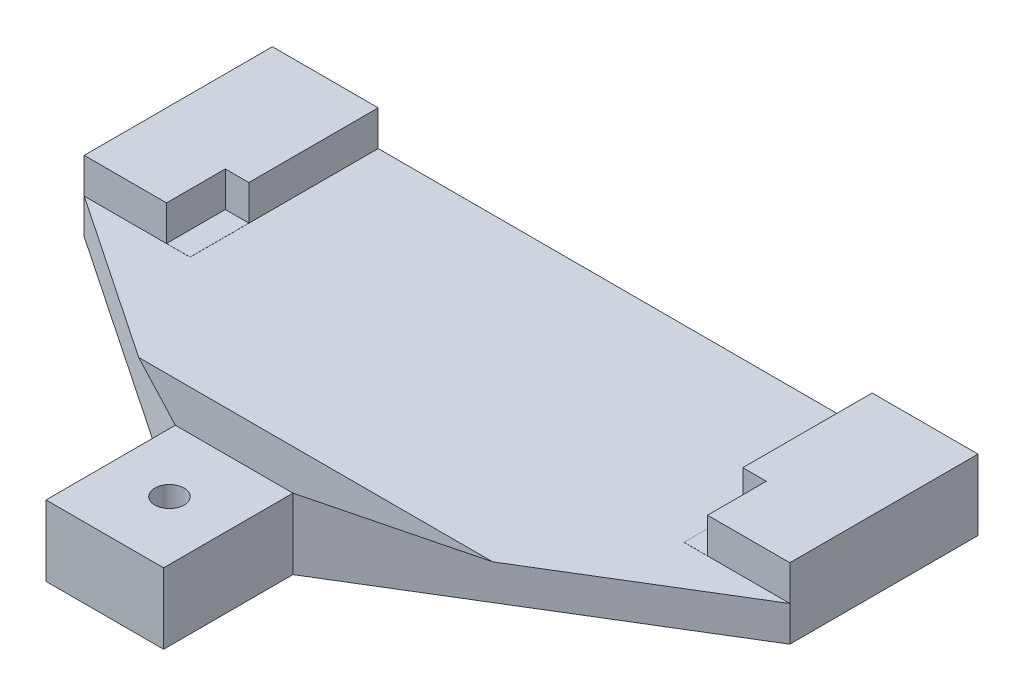
ISO-10303-21;
HEADER;
FILE_DESCRIPTION(('STEP AP214'),'2;1');
FILE_NAME('part.step','',(''),(''),'','','');
FILE_SCHEMA(('AUTOMOTIVE_DESIGN { 1 0 10303 214 1 1 1 1 }'));
ENDSEC;
DATA;
#1=APPLICATION_CONTEXT('core data for automotive mechanical design processes');
#2=APPLICATION_PROTOCOL_DEFINITION('international standard','automotive_design',2000,#1);
#3=PRODUCT_CONTEXT('',#1,'mechanical');
#4=PRODUCT('Part','Part','',(#3));
#5=PRODUCT_RELATED_PRODUCT_CATEGORY('part','',(#4));
#6=PRODUCT_DEFINITION_FORMATION('','',#4);
#7=PRODUCT_DEFINITION_CONTEXT('part definition',#1,'design');
#8=PRODUCT_DEFINITION('design','',#6,#7);
#9=PRODUCT_DEFINITION_SHAPE('','',#8);
#10=(LENGTH_UNIT() NAMED_UNIT(*) SI_UNIT(.MILLI.,.METRE.));
#11=(NAMED_UNIT(*) PLANE_ANGLE_UNIT() SI_UNIT($,.RADIAN.));
#12=(NAMED_UNIT(*) SI_UNIT($,.STERADIAN.) SOLID_ANGLE_UNIT());
#13=UNCERTAINTY_MEASURE_WITH_UNIT(LENGTH_MEASURE(1.E-05),#10,'distance_accuracy_value','');
#14=(GEOMETRIC_REPRESENTATION_CONTEXT(3) GLOBAL_UNCERTAINTY_ASSIGNED_CONTEXT((#13)) GLOBAL_UNIT_ASSIGNED_CONTEXT((#10,
#11,#12)) REPRESENTATION_CONTEXT('',''));
#15=CARTESIAN_POINT('',(0.,0.,0.));
#16=DIRECTION('',(0.,0.,1.));
#17=DIRECTION('',(1.,0.,0.));
#18=AXIS2_PLACEMENT_3D('',#15,#16,#17);
#19=CARTESIAN_POINT('',(0.,6.,60.));
#20=DIRECTION('',(0.,-1.,0.));
#21=DIRECTION('',(0.,0.,-1.));
#22=AXIS2_PLACEMENT_3D('',#19,#20,#21);
#23=PLANE('',#22);
#24=DIRECTION('',(-1.,0.,0.));
#25=VECTOR('',#24,1.);
#26=CARTESIAN_POINT('',(0.,6.,16.));
#27=LINE('',#26,#25);
#28=CARTESIAN_POINT('',(7.,6.,16.));
#29=VERTEX_POINT('',#28);
#30=CARTESIAN_POINT('',(0.,6.,16.));
#31=VERTEX_POINT('',#30);
#32=EDGE_CURVE('E270',#29,#31,#27,.T.);
#33=ORIENTED_EDGE('',*,*,#32,.F.);
#34=DIRECTION('',(0.,0.,1.));
#35=VECTOR('',#34,1.);
#36=CARTESIAN_POINT('',(7.,6.,16.));
#37=LINE('',#36,#35);
#38=CARTESIAN_POINT('',(7.,6.,11.));
#39=VERTEX_POINT('',#38);
#40=EDGE_CURVE('E187',#39,#29,#37,.T.);
#41=ORIENTED_EDGE('',*,*,#40,.F.);
#42=DIRECTION('',(-1.,0.,0.));
#43=VECTOR('',#42,1.);
#44=CARTESIAN_POINT('',(9.,6.,11.));
#45=LINE('',#44,#43);
#46=CARTESIAN_POINT('',(9.,6.,11.));
#47=VERTEX_POINT('',#46);
#48=EDGE_CURVE('E681',#47,#39,#45,.T.);
#49=ORIENTED_EDGE('',*,*,#48,.F.);
#50=DIRECTION('',(0.,0.,1.));
#51=VECTOR('',#50,1.);
#52=CARTESIAN_POINT('',(9.,6.,16.));
#53=LINE('',#52,#51);
#54=CARTESIAN_POINT('',(9.,6.,0.));
#55=VERTEX_POINT('',#54);
#56=EDGE_CURVE('E192',#55,#47,#53,.T.);
#57=ORIENTED_EDGE('',*,*,#56,.F.);
#58=DIRECTION('',(-1.,0.,0.));
#59=VECTOR('',#58,1.);
#60=CARTESIAN_POINT('',(0.,6.,0.));
#61=LINE('',#60,#59);
#62=CARTESIAN_POINT('',(0.,6.,0.));
#63=VERTEX_POINT('',#62);
#64=EDGE_CURVE('E329',#55,#63,#61,.T.);
#65=ORIENTED_EDGE('',*,*,#64,.T.);
#66=DIRECTION('',(0.,0.,-1.));
#67=VECTOR('',#66,1.);
#68=CARTESIAN_POINT('',(0.,6.,60.));
#69=LINE('',#68,#67);
#70=EDGE_CURVE('E333',#31,#63,#69,.T.);
#71=ORIENTED_EDGE('',*,*,#70,.F.);
#72=EDGE_LOOP('',(#33,#41,#49,#57,#65,#71));
#73=FACE_BOUND('',#72,.T.);
#74=ADVANCED_FACE('F33',(#73),#23,.F.);
#75=CARTESIAN_POINT('',(28.75,6.,37.5));
#76=DIRECTION('',(0.,1.,0.));
#77=DIRECTION('',(0.,0.,1.));
#78=AXIS2_PLACEMENT_3D('',#75,#76,#77);
#79=CIRCLE('',#78,1.25);
#80=CARTESIAN_POINT('',(28.75,6.,38.75));
#81=VERTEX_POINT('',#80);
#82=EDGE_CURVE('E291',#81,#81,#79,.T.);
#83=ORIENTED_EDGE('',*,*,#82,.F.);
#84=EDGE_LOOP('',(#83));
#85=FACE_BOUND('',#84,.T.);
#86=DIRECTION('',(0.,0.,1.));
#87=VECTOR('',#86,1.);
#88=CARTESIAN_POINT('',(23.75,6.,32.));
#89=LINE('',#88,#87);
#90=CARTESIAN_POINT('',(23.75,5.99999999999999,32.));
#91=VERTEX_POINT('',#90);
#92=CARTESIAN_POINT('',(23.75,6.,43.));
#93=VERTEX_POINT('',#92);
#94=EDGE_CURVE('E248',#91,#93,#89,.T.);
#95=ORIENTED_EDGE('',*,*,#94,.T.);
#96=DIRECTION('',(1.,0.,0.));
#97=VECTOR('',#96,1.);
#98=CARTESIAN_POINT('',(23.75,6.,43.));
#99=LINE('',#98,#97);
#100=CARTESIAN_POINT('',(33.75,6.,43.));
#101=VERTEX_POINT('',#100);
#102=EDGE_CURVE('E251',#93,#101,#99,.T.);
#103=ORIENTED_EDGE('',*,*,#102,.T.);
#104=DIRECTION('',(0.,0.,-1.));
#105=VECTOR('',#104,1.);
#106=CARTESIAN_POINT('',(33.75,6.,43.));
#107=LINE('',#106,#105);
#108=CARTESIAN_POINT('',(33.75,6.,32.));
#109=VERTEX_POINT('',#108);
#110=EDGE_CURVE('E254',#101,#109,#107,.T.);
#111=ORIENTED_EDGE('',*,*,#110,.T.);
#112=DIRECTION('',(-1.,0.,0.));
#113=VECTOR('',#112,1.);
#114=CARTESIAN_POINT('',(33.75,6.,32.));
#115=LINE('',#114,#113);
#116=EDGE_CURVE('E257',#109,#91,#115,.T.);
#117=ORIENTED_EDGE('',*,*,#116,.T.);
#118=EDGE_LOOP('',(#95,#103,#111,#117));
#119=FACE_BOUND('',#118,.T.);
#120=ADVANCED_FACE('F396',(#85,#119),#23,.F.);
#121=CARTESIAN_POINT('',(0.,0.,60.));
#122=DIRECTION('',(1.,0.,0.));
#123=DIRECTION('',(0.,0.,-1.));
#124=AXIS2_PLACEMENT_3D('',#121,#122,#123);
#125=PLANE('',#124);
#126=DIRECTION('',(0.,0.,-1.));
#127=VECTOR('',#126,1.);
#128=CARTESIAN_POINT('',(0.,0.,60.));
#129=LINE('',#128,#127);
#130=CARTESIAN_POINT('',(0.,0.,16.));
#131=VERTEX_POINT('',#130);
#132=CARTESIAN_POINT('',(0.,0.,0.));
#133=VERTEX_POINT('',#132);
#134=EDGE_CURVE('E339',#131,#133,#129,.T.);
#135=ORIENTED_EDGE('',*,*,#134,.F.);
#136=DIRECTION('',(0.,1.,0.));
#137=VECTOR('',#136,1.);
#138=CARTESIAN_POINT('',(0.,-49.,16.));
#139=LINE('',#138,#137);
#140=CARTESIAN_POINT('',(0.,3.,16.));
#141=VERTEX_POINT('',#140);
#142=EDGE_CURVE('E225',#131,#141,#139,.T.);
#143=ORIENTED_EDGE('',*,*,#142,.T.);
#144=DIRECTION('',(0.,1.,0.));
#145=VECTOR('',#144,1.);
#146=CARTESIAN_POINT('',(0.,3.,16.));
#147=LINE('',#146,#145);
#148=EDGE_CURVE('E288',#141,#31,#147,.T.);
#149=ORIENTED_EDGE('',*,*,#148,.T.);
#150=ORIENTED_EDGE('',*,*,#70,.T.);
#151=DIRECTION('',(0.,-1.,0.));
#152=VECTOR('',#151,1.);
#153=CARTESIAN_POINT('',(0.,0.,0.));
#154=LINE('',#153,#152);
#155=EDGE_CURVE('E318',#63,#133,#154,.T.);
#156=ORIENTED_EDGE('',*,*,#155,.T.);
#157=EDGE_LOOP('',(#135,#143,#149,#150,#156));
#158=FACE_BOUND('',#157,.T.);
#159=ADVANCED_FACE('F402',(#158),#125,.F.);
#160=CARTESIAN_POINT('',(0.,0.,60.));
#161=DIRECTION('',(0.,1.,0.));
#162=DIRECTION('',(0.,0.,1.));
#163=AXIS2_PLACEMENT_3D('',#160,#161,#162);
#164=PLANE('',#163);
#165=CARTESIAN_POINT('',(28.75,0.,37.5));
#166=DIRECTION('',(0.,1.,0.));
#167=DIRECTION('',(0.,0.,1.));
#168=AXIS2_PLACEMENT_3D('',#165,#166,#167);
#169=CIRCLE('',#168,1.25);
#170=CARTESIAN_POINT('',(28.75,0.,38.75));
#171=VERTEX_POINT('',#170);
#172=EDGE_CURVE('E305',#171,#171,#169,.T.);
#173=ORIENTED_EDGE('',*,*,#172,.T.);
#174=EDGE_LOOP('',(#173));
#175=FACE_BOUND('',#174,.T.);
#176=DIRECTION('',(0.,0.,-1.));
#177=VECTOR('',#176,1.);
#178=CARTESIAN_POINT('',(23.75,0.,60.));
#179=LINE('',#178,#177);
#180=CARTESIAN_POINT('',(23.75,0.,43.));
#181=VERTEX_POINT('',#180);
#182=CARTESIAN_POINT('',(23.75,0.,32.));
#183=VERTEX_POINT('',#182);
#184=EDGE_CURVE('E242',#181,#183,#179,.T.);
#185=ORIENTED_EDGE('',*,*,#184,.T.);
#186=DIRECTION('',(-0.829354370335837,0.,-0.558722944226248));
#187=VECTOR('',#186,1.);
#188=CARTESIAN_POINT('',(20.3886898864416,0.,29.7355384498133));
#189=LINE('',#188,#187);
#190=EDGE_CURVE('E245',#183,#131,#189,.T.);
#191=ORIENTED_EDGE('',*,*,#190,.T.);
#192=ORIENTED_EDGE('',*,*,#134,.T.);
#193=DIRECTION('',(1.,0.,0.));
#194=VECTOR('',#193,1.);
#195=CARTESIAN_POINT('',(0.,0.,0.));
#196=LINE('',#195,#194);
#197=CARTESIAN_POINT('',(60.,0.,0.));
#198=VERTEX_POINT('',#197);
#199=EDGE_CURVE('E323',#133,#198,#196,.T.);
#200=ORIENTED_EDGE('',*,*,#199,.T.);
#201=DIRECTION('',(0.,0.,-1.));
#202=VECTOR('',#201,1.);
#203=CARTESIAN_POINT('',(60.,0.,60.));
#204=LINE('',#203,#202);
#205=CARTESIAN_POINT('',(60.,0.,16.));
#206=VERTEX_POINT('',#205);
#207=EDGE_CURVE('E337',#206,#198,#204,.T.);
#208=ORIENTED_EDGE('',*,*,#207,.F.);
#209=DIRECTION('',(-0.853884327381244,0.,0.520462828118091));
#210=VECTOR('',#209,1.);
#211=CARTESIAN_POINT('',(-3.30136895707956,0.,54.5836915547913));
#212=LINE('',#211,#210);
#213=CARTESIAN_POINT('',(33.75,0.,32.));
#214=VERTEX_POINT('',#213);
#215=EDGE_CURVE('E228',#206,#214,#212,.T.);
#216=ORIENTED_EDGE('',*,*,#215,.T.);
#217=DIRECTION('',(0.,0.,1.));
#218=VECTOR('',#217,1.);
#219=CARTESIAN_POINT('',(33.75,0.,60.));
#220=LINE('',#219,#218);
#221=CARTESIAN_POINT('',(33.75,0.,43.));
#222=VERTEX_POINT('',#221);
#223=EDGE_CURVE('E236',#214,#222,#220,.T.);
#224=ORIENTED_EDGE('',*,*,#223,.T.);
#225=DIRECTION('',(-1.,0.,0.));
#226=VECTOR('',#225,1.);
#227=CARTESIAN_POINT('',(0.,0.,43.));
#228=LINE('',#227,#226);
#229=EDGE_CURVE('E239',#222,#181,#228,.T.);
#230=ORIENTED_EDGE('',*,*,#229,.T.);
#231=EDGE_LOOP('',(#185,#191,#192,#200,#208,#216,#224,#230));
#232=FACE_BOUND('',#231,.T.);
#233=ADVANCED_FACE('F415',(#175,#232),#164,.F.);
#234=CARTESIAN_POINT('',(60.,0.,60.));
#235=DIRECTION('',(-1.,0.,0.));
#236=DIRECTION('',(0.,0.,1.));
#237=AXIS2_PLACEMENT_3D('',#234,#235,#236);
#238=PLANE('',#237);
#239=DIRECTION('',(0.,1.,0.));
#240=VECTOR('',#239,1.);
#241=CARTESIAN_POINT('',(60.,3.,16.));
#242=LINE('',#241,#240);
#243=CARTESIAN_POINT('',(60.,3.,16.));
#244=VERTEX_POINT('',#243);
#245=CARTESIAN_POINT('',(60.,6.,16.));
#246=VERTEX_POINT('',#245);
#247=EDGE_CURVE('E281',#244,#246,#242,.T.);
#248=ORIENTED_EDGE('',*,*,#247,.F.);
#249=DIRECTION('',(0.,1.,0.));
#250=VECTOR('',#249,1.);
#251=CARTESIAN_POINT('',(60.,-49.,16.));
#252=LINE('',#251,#250);
#253=EDGE_CURVE('E224',#206,#244,#252,.T.);
#254=ORIENTED_EDGE('',*,*,#253,.F.);
#255=ORIENTED_EDGE('',*,*,#207,.T.);
#256=DIRECTION('',(0.,1.,0.));
#257=VECTOR('',#256,1.);
#258=CARTESIAN_POINT('',(60.,0.,0.));
#259=LINE('',#258,#257);
#260=CARTESIAN_POINT('',(60.,6.,0.));
#261=VERTEX_POINT('',#260);
#262=EDGE_CURVE('E326',#198,#261,#259,.T.);
#263=ORIENTED_EDGE('',*,*,#262,.T.);
#264=DIRECTION('',(0.,0.,-1.));
#265=VECTOR('',#264,1.);
#266=CARTESIAN_POINT('',(60.,6.,60.));
#267=LINE('',#266,#265);
#268=EDGE_CURVE('E335',#246,#261,#267,.T.);
#269=ORIENTED_EDGE('',*,*,#268,.F.);
#270=EDGE_LOOP('',(#248,#254,#255,#263,#269));
#271=FACE_BOUND('',#270,.T.);
#272=ADVANCED_FACE('F368',(#271),#238,.F.);
#273=DIRECTION('',(0.,0.,-1.));
#274=VECTOR('',#273,1.);
#275=CARTESIAN_POINT('',(51.,6.,0.));
#276=LINE('',#275,#274);
#277=CARTESIAN_POINT('',(51.,6.,11.));
#278=VERTEX_POINT('',#277);
#279=CARTESIAN_POINT('',(51.,6.,0.));
#280=VERTEX_POINT('',#279);
#281=EDGE_CURVE('E284',#278,#280,#276,.T.);
#282=ORIENTED_EDGE('',*,*,#281,.F.);
#283=DIRECTION('',(-1.,0.,0.));
#284=VECTOR('',#283,1.);
#285=CARTESIAN_POINT('',(51.,6.,11.));
#286=LINE('',#285,#284);
#287=CARTESIAN_POINT('',(53.,6.,11.));
#288=VERTEX_POINT('',#287);
#289=EDGE_CURVE('E201',#288,#278,#286,.T.);
#290=ORIENTED_EDGE('',*,*,#289,.F.);
#291=DIRECTION('',(0.,0.,-1.));
#292=VECTOR('',#291,1.);
#293=CARTESIAN_POINT('',(53.,6.,16.));
#294=LINE('',#293,#292);
#295=CARTESIAN_POINT('',(53.,6.,16.));
#296=VERTEX_POINT('',#295);
#297=EDGE_CURVE('E209',#296,#288,#294,.T.);
#298=ORIENTED_EDGE('',*,*,#297,.F.);
#299=DIRECTION('',(-1.,0.,0.));
#300=VECTOR('',#299,1.);
#301=CARTESIAN_POINT('',(51.,6.,16.));
#302=LINE('',#301,#300);
#303=EDGE_CURVE('E264',#246,#296,#302,.T.);
#304=ORIENTED_EDGE('',*,*,#303,.F.);
#305=ORIENTED_EDGE('',*,*,#268,.T.);
#306=EDGE_CURVE('E330',#261,#280,#61,.T.);
#307=ORIENTED_EDGE('',*,*,#306,.T.);
#308=EDGE_LOOP('',(#282,#290,#298,#304,#305,#307));
#309=FACE_BOUND('',#308,.T.);
#310=ADVANCED_FACE('F374',(#309),#23,.F.);
#311=CARTESIAN_POINT('',(0.,0.,0.));
#312=DIRECTION('',(0.,0.,-1.));
#313=DIRECTION('',(-1.,0.,0.));
#314=AXIS2_PLACEMENT_3D('',#311,#312,#313);
#315=PLANE('',#314);
#316=DIRECTION('',(0.,1.,0.));
#317=VECTOR('',#316,1.);
#318=CARTESIAN_POINT('',(9.,3.,0.));
#319=LINE('',#318,#317);
#320=CARTESIAN_POINT('',(9.,3.,0.));
#321=VERTEX_POINT('',#320);
#322=EDGE_CURVE('E294',#321,#55,#319,.T.);
#323=ORIENTED_EDGE('',*,*,#322,.F.);
#324=DIRECTION('',(-1.,0.,0.));
#325=VECTOR('',#324,1.);
#326=CARTESIAN_POINT('',(9.,3.,0.));
#327=LINE('',#326,#325);
#328=CARTESIAN_POINT('',(51.,3.,0.));
#329=VERTEX_POINT('',#328);
#330=EDGE_CURVE('E272',#329,#321,#327,.T.);
#331=ORIENTED_EDGE('',*,*,#330,.F.);
#332=DIRECTION('',(0.,1.,0.));
#333=VECTOR('',#332,1.);
#334=CARTESIAN_POINT('',(51.,3.,0.));
#335=LINE('',#334,#333);
#336=EDGE_CURVE('E296',#329,#280,#335,.T.);
#337=ORIENTED_EDGE('',*,*,#336,.T.);
#338=ORIENTED_EDGE('',*,*,#306,.F.);
#339=ORIENTED_EDGE('',*,*,#262,.F.);
#340=ORIENTED_EDGE('',*,*,#199,.F.);
#341=ORIENTED_EDGE('',*,*,#155,.F.);
#342=ORIENTED_EDGE('',*,*,#64,.F.);
#343=EDGE_LOOP('',(#323,#331,#337,#338,#339,#340,#341,#342));
#344=FACE_BOUND('',#343,.T.);
#345=CARTESIAN_POINT('',(5.75,3.,0.));
#346=DIRECTION('',(0.,0.,-1.));
#347=DIRECTION('',(-1.,0.,0.));
#348=AXIS2_PLACEMENT_3D('',#345,#346,#347);
#349=CIRCLE('',#348,1.25);
#350=CARTESIAN_POINT('',(4.5,3.,0.));
#351=VERTEX_POINT('',#350);
#352=EDGE_CURVE('E308',#351,#351,#349,.T.);
#353=ORIENTED_EDGE('',*,*,#352,.F.);
#354=EDGE_LOOP('',(#353));
#355=FACE_BOUND('',#354,.T.);
#356=CARTESIAN_POINT('',(54.,3.,0.));
#357=DIRECTION('',(0.,0.,-1.));
#358=DIRECTION('',(-1.,0.,0.));
#359=AXIS2_PLACEMENT_3D('',#356,#357,#358);
#360=CIRCLE('',#359,1.25);
#361=CARTESIAN_POINT('',(52.75,3.,0.));
#362=VERTEX_POINT('',#361);
#363=EDGE_CURVE('E312',#362,#362,#360,.T.);
#364=ORIENTED_EDGE('',*,*,#363,.F.);
#365=EDGE_LOOP('',(#364));
#366=FACE_BOUND('',#365,.T.);
#367=ADVANCED_FACE('F408',(#344,#355,#366),#315,.T.);
#368=CARTESIAN_POINT('',(54.,3.,10.));
#369=DIRECTION('',(0.,0.,-1.));
#370=DIRECTION('',(-1.,0.,0.));
#371=AXIS2_PLACEMENT_3D('',#368,#369,#370);
#372=CYLINDRICAL_SURFACE('',#371,1.25);
#373=CARTESIAN_POINT('',(54.,3.,10.));
#374=DIRECTION('',(0.,0.,-1.));
#375=DIRECTION('',(-1.,0.,0.));
#376=AXIS2_PLACEMENT_3D('',#373,#374,#375);
#377=CIRCLE('',#376,1.25);
#378=CARTESIAN_POINT('',(52.75,3.,10.));
#379=VERTEX_POINT('',#378);
#380=EDGE_CURVE('E315',#379,#379,#377,.T.);
#381=ORIENTED_EDGE('',*,*,#380,.F.);
#382=EDGE_LOOP('',(#381));
#383=FACE_BOUND('',#382,.T.);
#384=ORIENTED_EDGE('',*,*,#363,.T.);
#385=EDGE_LOOP('',(#384));
#386=FACE_BOUND('',#385,.T.);
#387=ADVANCED_FACE('F413',(#383,#386),#372,.F.);
#388=CARTESIAN_POINT('',(54.,3.,10.));
#389=DIRECTION('',(0.,0.,-1.));
#390=DIRECTION('',(-1.,0.,0.));
#391=AXIS2_PLACEMENT_3D('',#388,#389,#390);
#392=PLANE('',#391);
#393=ORIENTED_EDGE('',*,*,#380,.T.);
#394=EDGE_LOOP('',(#393));
#395=FACE_BOUND('',#394,.T.);
#396=ADVANCED_FACE('F482',(#395),#392,.T.);
#397=CARTESIAN_POINT('',(5.75,3.,10.));
#398=DIRECTION('',(0.,0.,-1.));
#399=DIRECTION('',(-1.,0.,0.));
#400=AXIS2_PLACEMENT_3D('',#397,#398,#399);
#401=CYLINDRICAL_SURFACE('',#400,1.25);
#402=CARTESIAN_POINT('',(5.75,3.,10.));
#403=DIRECTION('',(0.,0.,-1.));
#404=DIRECTION('',(-1.,0.,0.));
#405=AXIS2_PLACEMENT_3D('',#402,#403,#404);
#406=CIRCLE('',#405,1.25);
#407=CARTESIAN_POINT('',(4.5,3.,10.));
#408=VERTEX_POINT('',#407);
#409=EDGE_CURVE('E309',#408,#408,#406,.T.);
#410=ORIENTED_EDGE('',*,*,#409,.F.);
#411=EDGE_LOOP('',(#410));
#412=FACE_BOUND('',#411,.T.);
#413=ORIENTED_EDGE('',*,*,#352,.T.);
#414=EDGE_LOOP('',(#413));
#415=FACE_BOUND('',#414,.T.);
#416=ADVANCED_FACE('F478',(#412,#415),#401,.F.);
#417=CARTESIAN_POINT('',(5.75,3.,10.));
#418=DIRECTION('',(0.,0.,-1.));
#419=DIRECTION('',(-1.,0.,0.));
#420=AXIS2_PLACEMENT_3D('',#417,#418,#419);
#421=PLANE('',#420);
#422=ORIENTED_EDGE('',*,*,#409,.T.);
#423=EDGE_LOOP('',(#422));
#424=FACE_BOUND('',#423,.T.);
#425=ADVANCED_FACE('F474',(#424),#421,.T.);
#426=CARTESIAN_POINT('',(28.75,-9.,37.5));
#427=DIRECTION('',(0.,1.,0.));
#428=DIRECTION('',(0.,0.,1.));
#429=AXIS2_PLACEMENT_3D('',#426,#427,#428);
#430=CYLINDRICAL_SURFACE('',#429,1.25);
#431=ORIENTED_EDGE('',*,*,#82,.T.);
#432=EDGE_LOOP('',(#431));
#433=FACE_BOUND('',#432,.T.);
#434=ORIENTED_EDGE('',*,*,#172,.F.);
#435=EDGE_LOOP('',(#434));
#436=FACE_BOUND('',#435,.T.);
#437=ADVANCED_FACE('F464',(#433,#436),#430,.F.);
#438=CARTESIAN_POINT('',(0.,3.,16.));
#439=DIRECTION('',(0.,0.,-1.));
#440=DIRECTION('',(-1.,0.,0.));
#441=AXIS2_PLACEMENT_3D('',#438,#439,#440);
#442=PLANE('',#441);
#443=DIRECTION('',(1.,0.,0.));
#444=VECTOR('',#443,1.);
#445=CARTESIAN_POINT('',(9.,3.01,16.));
#446=LINE('',#445,#444);
#447=CARTESIAN_POINT('',(7.,3.01,16.));
#448=VERTEX_POINT('',#447);
#449=CARTESIAN_POINT('',(9.,3.01,16.));
#450=VERTEX_POINT('',#449);
#451=EDGE_CURVE('E48',#448,#450,#446,.T.);
#452=ORIENTED_EDGE('',*,*,#451,.F.);
#453=DIRECTION('',(0.,1.,0.));
#454=VECTOR('',#453,1.);
#455=CARTESIAN_POINT('',(7.,3.01,16.));
#456=LINE('',#455,#454);
#457=EDGE_CURVE('E194',#448,#29,#456,.T.);
#458=ORIENTED_EDGE('',*,*,#457,.T.);
#459=ORIENTED_EDGE('',*,*,#32,.T.);
#460=ORIENTED_EDGE('',*,*,#148,.F.);
#461=DIRECTION('',(-1.,0.,0.));
#462=VECTOR('',#461,1.);
#463=CARTESIAN_POINT('',(0.,3.,16.));
#464=LINE('',#463,#462);
#465=CARTESIAN_POINT('',(9.,3.,16.));
#466=VERTEX_POINT('',#465);
#467=EDGE_CURVE('E278',#466,#141,#464,.T.);
#468=ORIENTED_EDGE('',*,*,#467,.F.);
#469=DIRECTION('',(0.,1.,0.));
#470=VECTOR('',#469,1.);
#471=CARTESIAN_POINT('',(9.,3.,16.));
#472=LINE('',#471,#470);
#473=EDGE_CURVE('E292',#466,#450,#472,.T.);
#474=ORIENTED_EDGE('',*,*,#473,.T.);
#475=EDGE_LOOP('',(#452,#458,#459,#460,#468,#474));
#476=FACE_BOUND('',#475,.T.);
#477=ADVANCED_FACE('F461',(#476),#442,.F.);
#478=CARTESIAN_POINT('',(9.,3.,16.));
#479=DIRECTION('',(-1.,0.,0.));
#480=DIRECTION('',(0.,0.,1.));
#481=AXIS2_PLACEMENT_3D('',#478,#479,#480);
#482=PLANE('',#481);
#483=ORIENTED_EDGE('',*,*,#56,.T.);
#484=DIRECTION('',(0.,1.,0.));
#485=VECTOR('',#484,1.);
#486=CARTESIAN_POINT('',(9.,3.01,11.));
#487=LINE('',#486,#485);
#488=CARTESIAN_POINT('',(9.,3.01,11.));
#489=VERTEX_POINT('',#488);
#490=EDGE_CURVE('E177',#489,#47,#487,.T.);
#491=ORIENTED_EDGE('',*,*,#490,.F.);
#492=DIRECTION('',(0.,0.,-1.));
#493=VECTOR('',#492,1.);
#494=CARTESIAN_POINT('',(9.,3.01,16.));
#495=LINE('',#494,#493);
#496=EDGE_CURVE('E182',#450,#489,#495,.T.);
#497=ORIENTED_EDGE('',*,*,#496,.F.);
#498=ORIENTED_EDGE('',*,*,#473,.F.);
#499=DIRECTION('',(0.,0.,1.));
#500=VECTOR('',#499,1.);
#501=CARTESIAN_POINT('',(9.,3.,16.));
#502=LINE('',#501,#500);
#503=EDGE_CURVE('E275',#321,#466,#502,.T.);
#504=ORIENTED_EDGE('',*,*,#503,.F.);
#505=ORIENTED_EDGE('',*,*,#322,.T.);
#506=EDGE_LOOP('',(#483,#491,#497,#498,#504,#505));
#507=FACE_BOUND('',#506,.T.);
#508=ADVANCED_FACE('F190',(#507),#482,.F.);
#509=CARTESIAN_POINT('',(51.,3.,0.));
#510=DIRECTION('',(1.,0.,0.));
#511=DIRECTION('',(0.,0.,-1.));
#512=AXIS2_PLACEMENT_3D('',#509,#510,#511);
#513=PLANE('',#512);
#514=DIRECTION('',(0.,0.,1.));
#515=VECTOR('',#514,1.);
#516=CARTESIAN_POINT('',(51.,3.01,16.));
#517=LINE('',#516,#515);
#518=CARTESIAN_POINT('',(51.,3.01,11.));
#519=VERTEX_POINT('',#518);
#520=CARTESIAN_POINT('',(51.,3.01,16.));
#521=VERTEX_POINT('',#520);
#522=EDGE_CURVE('E56',#519,#521,#517,.T.);
#523=ORIENTED_EDGE('',*,*,#522,.F.);
#524=DIRECTION('',(0.,1.,0.));
#525=VECTOR('',#524,1.);
#526=CARTESIAN_POINT('',(51.,3.01,11.));
#527=LINE('',#526,#525);
#528=EDGE_CURVE('E213',#519,#278,#527,.T.);
#529=ORIENTED_EDGE('',*,*,#528,.T.);
#530=ORIENTED_EDGE('',*,*,#281,.T.);
#531=ORIENTED_EDGE('',*,*,#336,.F.);
#532=DIRECTION('',(0.,0.,-1.));
#533=VECTOR('',#532,1.);
#534=CARTESIAN_POINT('',(51.,3.,0.));
#535=LINE('',#534,#533);
#536=CARTESIAN_POINT('',(51.,3.,16.));
#537=VERTEX_POINT('',#536);
#538=EDGE_CURVE('E269',#537,#329,#535,.T.);
#539=ORIENTED_EDGE('',*,*,#538,.F.);
#540=DIRECTION('',(0.,1.,0.));
#541=VECTOR('',#540,1.);
#542=CARTESIAN_POINT('',(51.,3.,16.));
#543=LINE('',#542,#541);
#544=EDGE_CURVE('E299',#537,#521,#543,.T.);
#545=ORIENTED_EDGE('',*,*,#544,.T.);
#546=EDGE_LOOP('',(#523,#529,#530,#531,#539,#545));
#547=FACE_BOUND('',#546,.T.);
#548=ADVANCED_FACE('F436',(#547),#513,.F.);
#549=CARTESIAN_POINT('',(51.,3.,16.));
#550=DIRECTION('',(0.,0.,-1.));
#551=DIRECTION('',(-1.,0.,0.));
#552=AXIS2_PLACEMENT_3D('',#549,#550,#551);
#553=PLANE('',#552);
#554=ORIENTED_EDGE('',*,*,#303,.T.);
#555=DIRECTION('',(0.,1.,0.));
#556=VECTOR('',#555,1.);
#557=CARTESIAN_POINT('',(53.,3.01,16.));
#558=LINE('',#557,#556);
#559=CARTESIAN_POINT('',(53.,3.01,16.));
#560=VERTEX_POINT('',#559);
#561=EDGE_CURVE('E208',#560,#296,#558,.T.);
#562=ORIENTED_EDGE('',*,*,#561,.F.);
#563=DIRECTION('',(1.,0.,0.));
#564=VECTOR('',#563,1.);
#565=CARTESIAN_POINT('',(51.,3.01,16.));
#566=LINE('',#565,#564);
#567=EDGE_CURVE('E200',#521,#560,#566,.T.);
#568=ORIENTED_EDGE('',*,*,#567,.F.);
#569=ORIENTED_EDGE('',*,*,#544,.F.);
#570=DIRECTION('',(-1.,0.,0.));
#571=VECTOR('',#570,1.);
#572=CARTESIAN_POINT('',(51.,3.,16.));
#573=LINE('',#572,#571);
#574=EDGE_CURVE('E266',#244,#537,#573,.T.);
#575=ORIENTED_EDGE('',*,*,#574,.F.);
#576=ORIENTED_EDGE('',*,*,#247,.T.);
#577=EDGE_LOOP('',(#554,#562,#568,#569,#575,#576));
#578=FACE_BOUND('',#577,.T.);
#579=ADVANCED_FACE('F363',(#578),#553,.F.);
#580=CARTESIAN_POINT('',(0.,3.,0.));
#581=DIRECTION('',(0.,-1.,0.));
#582=DIRECTION('',(0.,0.,-1.));
#583=AXIS2_PLACEMENT_3D('',#580,#581,#582);
#584=PLANE('',#583);
#585=DIRECTION('',(-0.829354370335837,0.,-0.558722944226248));
#586=VECTOR('',#585,1.);
#587=CARTESIAN_POINT('',(23.75,3.,32.));
#588=LINE('',#587,#586);
#589=CARTESIAN_POINT('',(14.2002426196057,3.,25.5664792384712));
#590=VERTEX_POINT('',#589);
#591=EDGE_CURVE('E222',#590,#141,#588,.T.);
#592=ORIENTED_EDGE('',*,*,#591,.F.);
#593=DIRECTION('',(1.,0.,0.));
#594=VECTOR('',#593,1.);
#595=CARTESIAN_POINT('',(0.,3.,25.5664792384712));
#596=LINE('',#595,#594);
#597=CARTESIAN_POINT('',(44.3049949993832,3.,25.5664792384712));
#598=VERTEX_POINT('',#597);
#599=EDGE_CURVE('E341',#590,#598,#596,.T.);
#600=ORIENTED_EDGE('',*,*,#599,.T.);
#601=DIRECTION('',(-0.853884327381243,0.,0.520462828118091));
#602=VECTOR('',#601,1.);
#603=CARTESIAN_POINT('',(60.,3.,16.));
#604=LINE('',#603,#602);
#605=EDGE_CURVE('E216',#244,#598,#604,.T.);
#606=ORIENTED_EDGE('',*,*,#605,.F.);
#607=ORIENTED_EDGE('',*,*,#574,.T.);
#608=ORIENTED_EDGE('',*,*,#538,.T.);
#609=ORIENTED_EDGE('',*,*,#330,.T.);
#610=ORIENTED_EDGE('',*,*,#503,.T.);
#611=ORIENTED_EDGE('',*,*,#467,.T.);
#612=EDGE_LOOP('',(#592,#600,#606,#607,#608,#609,#610,#611));
#613=FACE_BOUND('',#612,.T.);
#614=ADVANCED_FACE('F352',(#613),#584,.F.);
#615=CARTESIAN_POINT('',(23.75,3.,32.));
#616=DIRECTION('',(-1.,0.,0.));
#617=DIRECTION('',(0.,0.,1.));
#618=AXIS2_PLACEMENT_3D('',#615,#616,#617);
#619=PLANE('',#618);
#620=ORIENTED_EDGE('',*,*,#94,.F.);
#621=DIRECTION('',(0.,1.,0.));
#622=VECTOR('',#621,1.);
#623=CARTESIAN_POINT('',(23.75,-49.,32.));
#624=LINE('',#623,#622);
#625=EDGE_CURVE('E229',#183,#91,#624,.T.);
#626=ORIENTED_EDGE('',*,*,#625,.F.);
#627=ORIENTED_EDGE('',*,*,#184,.F.);
#628=DIRECTION('',(0.,1.,0.));
#629=VECTOR('',#628,1.);
#630=CARTESIAN_POINT('',(23.75,3.,43.));
#631=LINE('',#630,#629);
#632=EDGE_CURVE('E260',#181,#93,#631,.T.);
#633=ORIENTED_EDGE('',*,*,#632,.T.);
#634=EDGE_LOOP('',(#620,#626,#627,#633));
#635=FACE_BOUND('',#634,.T.);
#636=ADVANCED_FACE('F451',(#635),#619,.T.);
#637=CARTESIAN_POINT('',(33.75,3.,43.));
#638=DIRECTION('',(1.,0.,0.));
#639=DIRECTION('',(0.,0.,-1.));
#640=AXIS2_PLACEMENT_3D('',#637,#638,#639);
#641=PLANE('',#640);
#642=ORIENTED_EDGE('',*,*,#110,.F.);
#643=DIRECTION('',(0.,1.,0.));
#644=VECTOR('',#643,1.);
#645=CARTESIAN_POINT('',(33.75,3.,43.));
#646=LINE('',#645,#644);
#647=EDGE_CURVE('E261',#222,#101,#646,.T.);
#648=ORIENTED_EDGE('',*,*,#647,.F.);
#649=ORIENTED_EDGE('',*,*,#223,.F.);
#650=DIRECTION('',(0.,1.,0.));
#651=VECTOR('',#650,1.);
#652=CARTESIAN_POINT('',(33.75,-49.,32.));
#653=LINE('',#652,#651);
#654=EDGE_CURVE('E231',#214,#109,#653,.T.);
#655=ORIENTED_EDGE('',*,*,#654,.T.);
#656=EDGE_LOOP('',(#642,#648,#649,#655));
#657=FACE_BOUND('',#656,.T.);
#658=ADVANCED_FACE('F448',(#657),#641,.T.);
#659=CARTESIAN_POINT('',(23.75,3.,43.));
#660=DIRECTION('',(0.,0.,1.));
#661=DIRECTION('',(1.,0.,0.));
#662=AXIS2_PLACEMENT_3D('',#659,#660,#661);
#663=PLANE('',#662);
#664=ORIENTED_EDGE('',*,*,#102,.F.);
#665=ORIENTED_EDGE('',*,*,#632,.F.);
#666=ORIENTED_EDGE('',*,*,#229,.F.);
#667=ORIENTED_EDGE('',*,*,#647,.T.);
#668=EDGE_LOOP('',(#664,#665,#666,#667));
#669=FACE_BOUND('',#668,.T.);
#670=ADVANCED_FACE('F445',(#669),#663,.T.);
#671=CARTESIAN_POINT('',(23.75,-49.,32.));
#672=DIRECTION('',(0.558722944226248,0.,-0.829354370335837));
#673=DIRECTION('',(-0.829354370335837,0.,-0.558722944226248));
#674=AXIS2_PLACEMENT_3D('',#671,#672,#673);
#675=PLANE('',#674);
#676=ORIENTED_EDGE('',*,*,#625,.T.);
#677=DIRECTION('',(-0.802562807163174,-0.252120376003742,-0.540673891141507));
#678=VECTOR('',#677,1.);
#679=CARTESIAN_POINT('',(12.6211659810271,2.50394238020524,24.5026802398498));
#680=LINE('',#679,#678);
#681=EDGE_CURVE('E41',#91,#590,#680,.T.);
#682=ORIENTED_EDGE('',*,*,#681,.T.);
#683=ORIENTED_EDGE('',*,*,#591,.T.);
#684=ORIENTED_EDGE('',*,*,#142,.F.);
#685=ORIENTED_EDGE('',*,*,#190,.F.);
#686=EDGE_LOOP('',(#676,#682,#683,#684,#685));
#687=FACE_BOUND('',#686,.T.);
#688=ADVANCED_FACE('F345',(#687),#675,.F.);
#689=CARTESIAN_POINT('',(60.,-49.,16.));
#690=DIRECTION('',(-0.520462828118091,0.,-0.853884327381243));
#691=DIRECTION('',(-0.853884327381244,0.,0.520462828118091));
#692=AXIS2_PLACEMENT_3D('',#689,#690,#691);
#693=PLANE('',#692);
#694=ORIENTED_EDGE('',*,*,#253,.T.);
#695=ORIENTED_EDGE('',*,*,#605,.T.);
#696=DIRECTION('',(-0.829795951008791,0.235849268822187,0.505780389186311));
#697=VECTOR('',#696,1.);
#698=CARTESIAN_POINT('',(69.303719220333,-4.10527789612707,10.3291616180828));
#699=LINE('',#698,#697);
#700=EDGE_CURVE('E11',#598,#109,#699,.T.);
#701=ORIENTED_EDGE('',*,*,#700,.T.);
#702=ORIENTED_EDGE('',*,*,#654,.F.);
#703=ORIENTED_EDGE('',*,*,#215,.F.);
#704=EDGE_LOOP('',(#694,#695,#701,#702,#703));
#705=FACE_BOUND('',#704,.T.);
#706=ADVANCED_FACE('F358',(#705),#693,.F.);
#707=CARTESIAN_POINT('',(33.75,5.99999999999999,32.));
#708=DIRECTION('',(0.,-0.906307787036653,0.422618261740692));
#709=DIRECTION('',(-1.,0.,0.));
#710=AXIS2_PLACEMENT_3D('',#707,#708,#709);
#711=PLANE('',#710);
#712=ORIENTED_EDGE('',*,*,#700,.F.);
#713=ORIENTED_EDGE('',*,*,#599,.F.);
#714=ORIENTED_EDGE('',*,*,#681,.F.);
#715=ORIENTED_EDGE('',*,*,#116,.F.);
#716=EDGE_LOOP('',(#712,#713,#714,#715));
#717=FACE_BOUND('',#716,.T.);
#718=ADVANCED_FACE('F35',(#717),#711,.F.);
#719=CARTESIAN_POINT('',(51.,3.01,11.));
#720=DIRECTION('',(0.,0.,-1.));
#721=DIRECTION('',(-1.,0.,0.));
#722=AXIS2_PLACEMENT_3D('',#719,#720,#721);
#723=PLANE('',#722);
#724=ORIENTED_EDGE('',*,*,#289,.T.);
#725=ORIENTED_EDGE('',*,*,#528,.F.);
#726=DIRECTION('',(-1.,0.,0.));
#727=VECTOR('',#726,1.);
#728=CARTESIAN_POINT('',(51.,3.01,11.));
#729=LINE('',#728,#727);
#730=CARTESIAN_POINT('',(53.,3.01,11.));
#731=VERTEX_POINT('',#730);
#732=EDGE_CURVE('E206',#731,#519,#729,.T.);
#733=ORIENTED_EDGE('',*,*,#732,.F.);
#734=DIRECTION('',(0.,1.,0.));
#735=VECTOR('',#734,1.);
#736=CARTESIAN_POINT('',(53.,3.01,11.));
#737=LINE('',#736,#735);
#738=EDGE_CURVE('E217',#731,#288,#737,.T.);
#739=ORIENTED_EDGE('',*,*,#738,.T.);
#740=EDGE_LOOP('',(#724,#725,#733,#739));
#741=FACE_BOUND('',#740,.T.);
#742=ADVANCED_FACE('F391',(#741),#723,.F.);
#743=CARTESIAN_POINT('',(53.,3.01,16.));
#744=DIRECTION('',(1.,0.,0.));
#745=DIRECTION('',(0.,0.,-1.));
#746=AXIS2_PLACEMENT_3D('',#743,#744,#745);
#747=PLANE('',#746);
#748=ORIENTED_EDGE('',*,*,#297,.T.);
#749=ORIENTED_EDGE('',*,*,#738,.F.);
#750=DIRECTION('',(0.,0.,-1.));
#751=VECTOR('',#750,1.);
#752=CARTESIAN_POINT('',(53.,3.01,16.));
#753=LINE('',#752,#751);
#754=EDGE_CURVE('E203',#560,#731,#753,.T.);
#755=ORIENTED_EDGE('',*,*,#754,.F.);
#756=ORIENTED_EDGE('',*,*,#561,.T.);
#757=EDGE_LOOP('',(#748,#749,#755,#756));
#758=FACE_BOUND('',#757,.T.);
#759=ADVANCED_FACE('F379',(#758),#747,.F.);
#760=CARTESIAN_POINT('',(0.,3.01,0.));
#761=DIRECTION('',(0.,-1.,0.));
#762=DIRECTION('',(0.,0.,-1.));
#763=AXIS2_PLACEMENT_3D('',#760,#761,#762);
#764=PLANE('',#763);
#765=ORIENTED_EDGE('',*,*,#522,.T.);
#766=ORIENTED_EDGE('',*,*,#567,.T.);
#767=ORIENTED_EDGE('',*,*,#754,.T.);
#768=ORIENTED_EDGE('',*,*,#732,.T.);
#769=EDGE_LOOP('',(#765,#766,#767,#768));
#770=FACE_BOUND('',#769,.T.);
#771=ADVANCED_FACE('F381',(#770),#764,.F.);
#772=CARTESIAN_POINT('',(7.,3.01,16.));
#773=DIRECTION('',(-1.,0.,0.));
#774=DIRECTION('',(0.,0.,1.));
#775=AXIS2_PLACEMENT_3D('',#772,#773,#774);
#776=PLANE('',#775);
#777=ORIENTED_EDGE('',*,*,#40,.T.);
#778=ORIENTED_EDGE('',*,*,#457,.F.);
#779=DIRECTION('',(0.,0.,1.));
#780=VECTOR('',#779,1.);
#781=CARTESIAN_POINT('',(7.,3.01,16.));
#782=LINE('',#781,#780);
#783=CARTESIAN_POINT('',(7.,3.01,11.));
#784=VERTEX_POINT('',#783);
#785=EDGE_CURVE('E181',#784,#448,#782,.T.);
#786=ORIENTED_EDGE('',*,*,#785,.F.);
#787=DIRECTION('',(0.,1.,0.));
#788=VECTOR('',#787,1.);
#789=CARTESIAN_POINT('',(7.,3.01,11.));
#790=LINE('',#789,#788);
#791=EDGE_CURVE('E179',#784,#39,#790,.T.);
#792=ORIENTED_EDGE('',*,*,#791,.T.);
#793=EDGE_LOOP('',(#777,#778,#786,#792));
#794=FACE_BOUND('',#793,.T.);
#795=ADVANCED_FACE('F383',(#794),#776,.F.);
#796=CARTESIAN_POINT('',(9.,3.01,11.));
#797=DIRECTION('',(0.,0.,-1.));
#798=DIRECTION('',(-1.,0.,0.));
#799=AXIS2_PLACEMENT_3D('',#796,#797,#798);
#800=PLANE('',#799);
#801=ORIENTED_EDGE('',*,*,#48,.T.);
#802=ORIENTED_EDGE('',*,*,#791,.F.);
#803=DIRECTION('',(-1.,0.,0.));
#804=VECTOR('',#803,1.);
#805=CARTESIAN_POINT('',(9.,3.01,11.));
#806=LINE('',#805,#804);
#807=EDGE_CURVE('E173',#489,#784,#806,.T.);
#808=ORIENTED_EDGE('',*,*,#807,.F.);
#809=ORIENTED_EDGE('',*,*,#490,.T.);
#810=EDGE_LOOP('',(#801,#802,#808,#809));
#811=FACE_BOUND('',#810,.T.);
#812=ADVANCED_FACE('F175',(#811),#800,.F.);
#813=CARTESIAN_POINT('',(0.,3.01,0.));
#814=DIRECTION('',(0.,1.,0.));
#815=DIRECTION('',(0.,0.,1.));
#816=AXIS2_PLACEMENT_3D('',#813,#814,#815);
#817=PLANE('',#816);
#818=ORIENTED_EDGE('',*,*,#496,.T.);
#819=ORIENTED_EDGE('',*,*,#807,.T.);
#820=ORIENTED_EDGE('',*,*,#785,.T.);
#821=ORIENTED_EDGE('',*,*,#451,.T.);
#822=EDGE_LOOP('',(#818,#819,#820,#821));
#823=FACE_BOUND('',#822,.T.);
#824=ADVANCED_FACE('F184',(#823),#817,.T.);
#825=CLOSED_SHELL('',(#74,#120,#159,#233,#272,#310,#367,#387,#396,#416,#425,#437,#477,#508,#548,
#579,#614,#636,#658,#670,#688,#706,#718,#742,#759,#771,#795,#812,#824));
#826=MANIFOLD_SOLID_BREP('B2',#825);
#827=ADVANCED_BREP_SHAPE_REPRESENTATION('',(#18,#826),#14);
#828=SHAPE_DEFINITION_REPRESENTATION(#9,#827);
ENDSEC;
END-ISO-10303-21;
